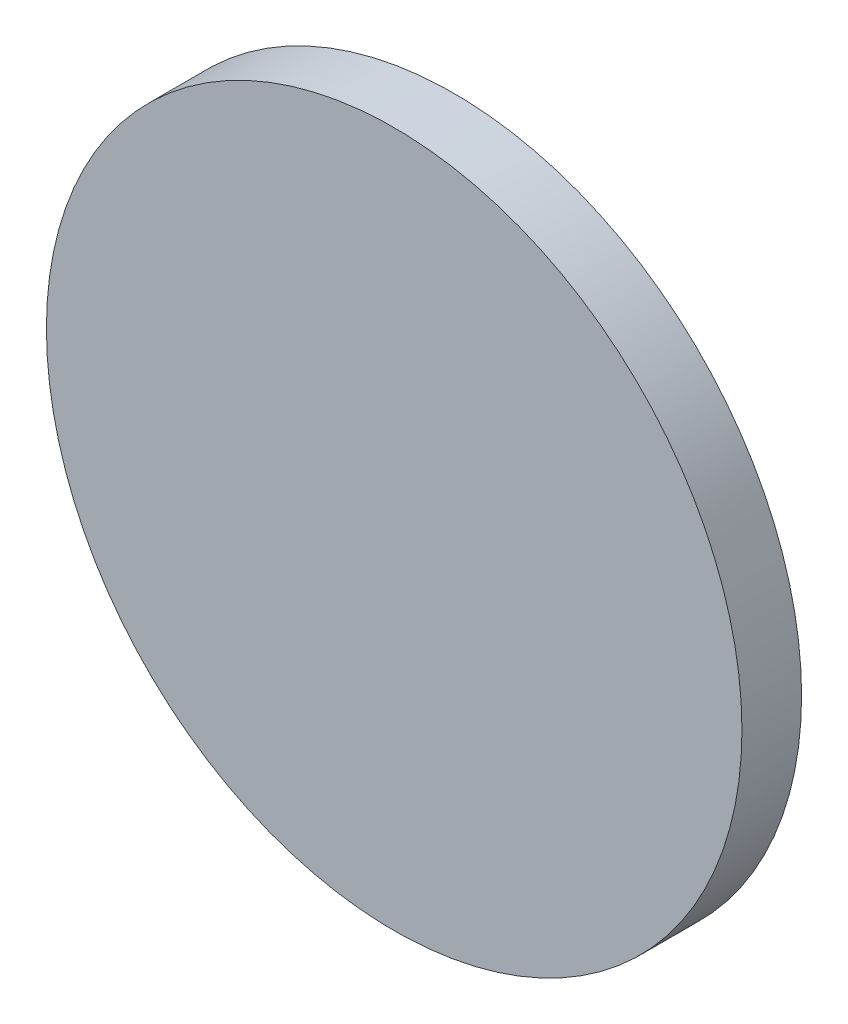
ISO-10303-21;
HEADER;
FILE_DESCRIPTION(('STEP AP214'),'2;1');
FILE_NAME('part.step','',(''),(''),'','','');
FILE_SCHEMA(('AUTOMOTIVE_DESIGN { 1 0 10303 214 1 1 1 1 }'));
ENDSEC;
DATA;
#1=APPLICATION_CONTEXT('core data for automotive mechanical design processes');
#2=APPLICATION_PROTOCOL_DEFINITION('international standard','automotive_design',2000,#1);
#3=PRODUCT_CONTEXT('',#1,'mechanical');
#4=PRODUCT('Part','Part','',(#3));
#5=PRODUCT_RELATED_PRODUCT_CATEGORY('part','',(#4));
#6=PRODUCT_DEFINITION_FORMATION('','',#4);
#7=PRODUCT_DEFINITION_CONTEXT('part definition',#1,'design');
#8=PRODUCT_DEFINITION('design','',#6,#7);
#9=PRODUCT_DEFINITION_SHAPE('','',#8);
#10=(LENGTH_UNIT() NAMED_UNIT(*) SI_UNIT(.MILLI.,.METRE.));
#11=(NAMED_UNIT(*) PLANE_ANGLE_UNIT() SI_UNIT($,.RADIAN.));
#12=(NAMED_UNIT(*) SI_UNIT($,.STERADIAN.) SOLID_ANGLE_UNIT());
#13=UNCERTAINTY_MEASURE_WITH_UNIT(LENGTH_MEASURE(1.E-05),#10,'distance_accuracy_value','');
#14=(GEOMETRIC_REPRESENTATION_CONTEXT(3) GLOBAL_UNCERTAINTY_ASSIGNED_CONTEXT((#13)) GLOBAL_UNIT_ASSIGNED_CONTEXT((#10,
#11,#12)) REPRESENTATION_CONTEXT('',''));
#15=CARTESIAN_POINT('',(0.,0.,0.));
#16=DIRECTION('',(0.,0.,1.));
#17=DIRECTION('',(1.,0.,0.));
#18=AXIS2_PLACEMENT_3D('',#15,#16,#17);
#19=CARTESIAN_POINT('',(10.752,6.394000014875,0.76487));
#20=DIRECTION('',(0.,0.,-1.));
#21=DIRECTION('',(-1.,0.,0.));
#22=AXIS2_PLACEMENT_3D('',#19,#20,#21);
#23=PLANE('',#22);
#24=CARTESIAN_POINT('',(10.752,6.394000014875,0.76487));
#25=DIRECTION('',(0.,0.,1.));
#26=DIRECTION('',(1.,0.,0.));
#27=AXIS2_PLACEMENT_3D('',#24,#25,#26);
#28=CIRCLE('',#27,0.200024667);
#29=CARTESIAN_POINT('',(10.952024667,6.394000014875,0.76487));
#30=VERTEX_POINT('',#29);
#31=EDGE_CURVE('E18',#30,#30,#28,.T.);
#32=ORIENTED_EDGE('',*,*,#31,.F.);
#33=EDGE_LOOP('',(#32));
#34=FACE_BOUND('',#33,.T.);
#35=ADVANCED_FACE('F15',(#34),#23,.T.);
#36=CARTESIAN_POINT('',(10.752,6.394000014875,0.76487));
#37=DIRECTION('',(0.,0.,1.));
#38=DIRECTION('',(1.,0.,0.));
#39=AXIS2_PLACEMENT_3D('',#36,#37,#38);
#40=CYLINDRICAL_SURFACE('',#39,0.200024667);
#41=CARTESIAN_POINT('',(10.752,6.394000014875,0.79916));
#42=DIRECTION('',(0.,0.,1.));
#43=DIRECTION('',(1.,0.,0.));
#44=AXIS2_PLACEMENT_3D('',#41,#42,#43);
#45=CIRCLE('',#44,0.200024667);
#46=CARTESIAN_POINT('',(10.952024667,6.394000014875,0.79916));
#47=VERTEX_POINT('',#46);
#48=EDGE_CURVE('E10',#47,#47,#45,.T.);
#49=ORIENTED_EDGE('',*,*,#48,.F.);
#50=EDGE_LOOP('',(#49));
#51=FACE_BOUND('',#50,.T.);
#52=ORIENTED_EDGE('',*,*,#31,.T.);
#53=EDGE_LOOP('',(#52));
#54=FACE_BOUND('',#53,.T.);
#55=ADVANCED_FACE('F27',(#51,#54),#40,.T.);
#56=CARTESIAN_POINT('',(10.752,6.394000014875,0.79916));
#57=DIRECTION('',(0.,0.,1.));
#58=DIRECTION('',(1.,0.,0.));
#59=AXIS2_PLACEMENT_3D('',#56,#57,#58);
#60=PLANE('',#59);
#61=ORIENTED_EDGE('',*,*,#48,.T.);
#62=EDGE_LOOP('',(#61));
#63=FACE_BOUND('',#62,.T.);
#64=ADVANCED_FACE('F34',(#63),#60,.T.);
#65=CLOSED_SHELL('',(#35,#55,#64));
#66=MANIFOLD_SOLID_BREP('B1',#65);
#67=ADVANCED_BREP_SHAPE_REPRESENTATION('',(#18,#66),#14);
#68=SHAPE_DEFINITION_REPRESENTATION(#9,#67);
ENDSEC;
END-ISO-10303-21;
